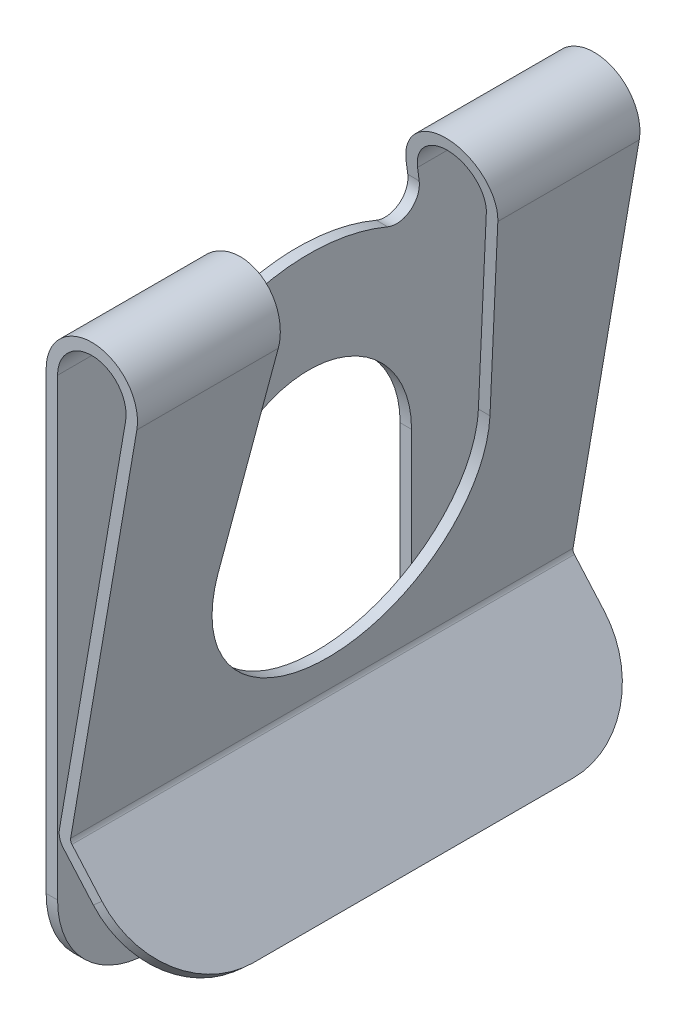
ISO-10303-21;
HEADER;
FILE_DESCRIPTION(('STEP AP214'),'2;1');
FILE_NAME('part.step','',(''),(''),'','','');
FILE_SCHEMA(('AUTOMOTIVE_DESIGN { 1 0 10303 214 1 1 1 1 }'));
ENDSEC;
DATA;
#1=APPLICATION_CONTEXT('core data for automotive mechanical design processes');
#2=APPLICATION_PROTOCOL_DEFINITION('international standard','automotive_design',2000,#1);
#3=PRODUCT_CONTEXT('',#1,'mechanical');
#4=PRODUCT('Part','Part','',(#3));
#5=PRODUCT_RELATED_PRODUCT_CATEGORY('part','',(#4));
#6=PRODUCT_DEFINITION_FORMATION('','',#4);
#7=PRODUCT_DEFINITION_CONTEXT('part definition',#1,'design');
#8=PRODUCT_DEFINITION('design','',#6,#7);
#9=PRODUCT_DEFINITION_SHAPE('','',#8);
#10=(LENGTH_UNIT() NAMED_UNIT(*) SI_UNIT(.MILLI.,.METRE.));
#11=(NAMED_UNIT(*) PLANE_ANGLE_UNIT() SI_UNIT($,.RADIAN.));
#12=(NAMED_UNIT(*) SI_UNIT($,.STERADIAN.) SOLID_ANGLE_UNIT());
#13=UNCERTAINTY_MEASURE_WITH_UNIT(LENGTH_MEASURE(1.E-05),#10,'distance_accuracy_value','');
#14=(GEOMETRIC_REPRESENTATION_CONTEXT(3) GLOBAL_UNCERTAINTY_ASSIGNED_CONTEXT((#13)) GLOBAL_UNIT_ASSIGNED_CONTEXT((#10,
#11,#12)) REPRESENTATION_CONTEXT('',''));
#15=CARTESIAN_POINT('',(0.,0.,0.));
#16=DIRECTION('',(0.,0.,1.));
#17=DIRECTION('',(1.,0.,0.));
#18=AXIS2_PLACEMENT_3D('',#15,#16,#17);
#19=CARTESIAN_POINT('',(0.75519648958121,-8.00818279753097,11.));
#20=DIRECTION('',(0.752689516996334,0.658375645816145,0.));
#21=DIRECTION('',(-0.658375645816145,0.752689516996334,0.));
#22=AXIS2_PLACEMENT_3D('',#19,#20,#21);
#23=PLANE('',#22);
#24=CARTESIAN_POINT('',(2.06668077604698,-9.50754031538768,7.00000000000002));
#25=DIRECTION('',(0.752689516996334,0.658375645816145,0.));
#26=DIRECTION('',(-0.658375645816145,0.752689516996334,0.));
#27=AXIS2_PLACEMENT_3D('',#24,#25,#26);
#28=CIRCLE('',#27,3.99999999999998);
#29=CARTESIAN_POINT('',(2.06668077604697,-9.50754031538767,11.));
#30=VERTEX_POINT('',#29);
#31=CARTESIAN_POINT('',(4.70018335931155,-12.518298383373,7.));
#32=VERTEX_POINT('',#31);
#33=EDGE_CURVE('E405',#30,#32,#28,.T.);
#34=ORIENTED_EDGE('',*,*,#33,.F.);
#35=DIRECTION('',(0.658375645816145,-0.752689516996334,0.));
#36=VECTOR('',#35,1.);
#37=CARTESIAN_POINT('',(0.75519648958121,-8.00818279753097,11.));
#38=LINE('',#37,#36);
#39=CARTESIAN_POINT('',(0.75519648958121,-8.00818279753097,11.));
#40=VERTEX_POINT('',#39);
#41=EDGE_CURVE('E288',#40,#30,#38,.T.);
#42=ORIENTED_EDGE('',*,*,#41,.F.);
#43=DIRECTION('',(0.,0.,-1.));
#44=VECTOR('',#43,1.);
#45=CARTESIAN_POINT('',(0.75519648958121,-8.00818279753097,11.));
#46=LINE('',#45,#44);
#47=CARTESIAN_POINT('',(0.75519648958121,-8.00818279753097,-11.));
#48=VERTEX_POINT('',#47);
#49=EDGE_CURVE('E305',#40,#48,#46,.T.);
#50=ORIENTED_EDGE('',*,*,#49,.T.);
#51=DIRECTION('',(0.658375645816145,-0.752689516996334,0.));
#52=VECTOR('',#51,1.);
#53=CARTESIAN_POINT('',(0.75519648958121,-8.00818279753097,-11.));
#54=LINE('',#53,#52);
#55=CARTESIAN_POINT('',(2.06668077604697,-9.50754031538767,-11.));
#56=VERTEX_POINT('',#55);
#57=EDGE_CURVE('E264',#48,#56,#54,.T.);
#58=ORIENTED_EDGE('',*,*,#57,.T.);
#59=CARTESIAN_POINT('',(2.06668077604697,-9.50754031538767,-7.));
#60=DIRECTION('',(0.752689516996334,0.658375645816145,0.));
#61=DIRECTION('',(-0.658375645816145,0.752689516996334,0.));
#62=AXIS2_PLACEMENT_3D('',#59,#60,#61);
#63=CIRCLE('',#62,4.);
#64=CARTESIAN_POINT('',(4.70018335931155,-12.518298383373,-7.));
#65=VERTEX_POINT('',#64);
#66=EDGE_CURVE('E48',#65,#56,#63,.T.);
#67=ORIENTED_EDGE('',*,*,#66,.F.);
#68=DIRECTION('',(0.,0.,-1.));
#69=VECTOR('',#68,1.);
#70=CARTESIAN_POINT('',(4.70018335931155,-12.518298383373,11.));
#71=LINE('',#70,#69);
#72=EDGE_CURVE('E406',#32,#65,#71,.T.);
#73=ORIENTED_EDGE('',*,*,#72,.F.);
#74=EDGE_LOOP('',(#34,#42,#50,#58,#67,#73));
#75=FACE_BOUND('',#74,.T.);
#76=ADVANCED_FACE('F33',(#75),#23,.F.);
#77=CARTESIAN_POINT('',(5.07677605410829,-12.1893940142257,11.));
#78=DIRECTION('',(-0.752689516996333,-0.658375645816146,0.));
#79=DIRECTION('',(0.658375645816146,-0.752689516996333,0.));
#80=AXIS2_PLACEMENT_3D('',#77,#78,#79);
#81=PLANE('',#80);
#82=CARTESIAN_POINT('',(2.44302553454515,-9.17835249247961,7.00000000000002));
#83=DIRECTION('',(-0.752689516996333,-0.658375645816146,0.));
#84=DIRECTION('',(0.658375645816146,-0.752689516996333,0.));
#85=AXIS2_PLACEMENT_3D('',#82,#83,#84);
#86=CIRCLE('',#85,3.99999999999998);
#87=CARTESIAN_POINT('',(5.07652811780973,-12.1891105604649,7.));
#88=VERTEX_POINT('',#87);
#89=CARTESIAN_POINT('',(2.44302553454514,-9.1783524924796,11.));
#90=VERTEX_POINT('',#89);
#91=EDGE_CURVE('E341',#88,#90,#86,.T.);
#92=ORIENTED_EDGE('',*,*,#91,.F.);
#93=DIRECTION('',(0.,0.,1.));
#94=VECTOR('',#93,1.);
#95=CARTESIAN_POINT('',(5.07652811780973,-12.1891105604649,11.));
#96=LINE('',#95,#94);
#97=CARTESIAN_POINT('',(5.07652811780973,-12.1891105604649,-7.));
#98=VERTEX_POINT('',#97);
#99=EDGE_CURVE('E11',#98,#88,#96,.T.);
#100=ORIENTED_EDGE('',*,*,#99,.F.);
#101=CARTESIAN_POINT('',(2.44302553454514,-9.17835249247959,-7.));
#102=DIRECTION('',(-0.752689516996333,-0.658375645816146,0.));
#103=DIRECTION('',(0.658375645816146,-0.752689516996333,0.));
#104=AXIS2_PLACEMENT_3D('',#101,#102,#103);
#105=CIRCLE('',#104,4.);
#106=CARTESIAN_POINT('',(2.44302553454514,-9.1783524924796,-11.));
#107=VERTEX_POINT('',#106);
#108=EDGE_CURVE('E242',#107,#98,#105,.T.);
#109=ORIENTED_EDGE('',*,*,#108,.F.);
#110=DIRECTION('',(-0.658375645816146,0.752689516996332,0.));
#111=VECTOR('',#110,1.);
#112=CARTESIAN_POINT('',(5.07677605410829,-12.1893940142257,-11.));
#113=LINE('',#112,#111);
#114=CARTESIAN_POINT('',(1.13154124807938,-7.6789949746229,-11.));
#115=VERTEX_POINT('',#114);
#116=EDGE_CURVE('E255',#107,#115,#113,.T.);
#117=ORIENTED_EDGE('',*,*,#116,.T.);
#118=DIRECTION('',(0.,0.,-1.));
#119=VECTOR('',#118,1.);
#120=CARTESIAN_POINT('',(1.13154124807938,-7.6789949746229,11.));
#121=LINE('',#120,#119);
#122=CARTESIAN_POINT('',(1.13154124807938,-7.6789949746229,11.));
#123=VERTEX_POINT('',#122);
#124=EDGE_CURVE('E303',#123,#115,#121,.T.);
#125=ORIENTED_EDGE('',*,*,#124,.F.);
#126=DIRECTION('',(-0.658375645816146,0.752689516996332,0.));
#127=VECTOR('',#126,1.);
#128=CARTESIAN_POINT('',(5.07677605410829,-12.1893940142257,11.));
#129=LINE('',#128,#127);
#130=EDGE_CURVE('E291',#90,#123,#129,.T.);
#131=ORIENTED_EDGE('',*,*,#130,.F.);
#132=EDGE_LOOP('',(#92,#100,#109,#117,#125,#131));
#133=FACE_BOUND('',#132,.T.);
#134=ADVANCED_FACE('F253',(#133),#81,.F.);
#135=CARTESIAN_POINT('',(2.,9.80000000000003,11.));
#136=DIRECTION('',(0.,0.,1.));
#137=DIRECTION('',(1.,0.,0.));
#138=AXIS2_PLACEMENT_3D('',#135,#136,#137);
#139=PLANE('',#138);
#140=ORIENTED_EDGE('',*,*,#41,.T.);
#141=DIRECTION('',(0.752689516996333,0.658375645816146,0.));
#142=VECTOR('',#141,1.);
#143=CARTESIAN_POINT('',(11.5968021945387,-1.1715668470122,11.));
#144=LINE('',#143,#142);
#145=EDGE_CURVE('E41',#30,#90,#144,.T.);
#146=ORIENTED_EDGE('',*,*,#145,.T.);
#147=ORIENTED_EDGE('',*,*,#130,.T.);
#148=CARTESIAN_POINT('',(1.31971362732848,-7.51440106316886,11.));
#149=DIRECTION('',(0.,0.,-1.));
#150=DIRECTION('',(-1.,0.,0.));
#151=AXIS2_PLACEMENT_3D('',#148,#149,#150);
#152=CIRCLE('',#151,0.250000000000019);
#153=CARTESIAN_POINT('',(1.07329577634756,-7.47223184788145,11.));
#154=VERTEX_POINT('',#153);
#155=EDGE_CURVE('E293',#123,#154,#152,.T.);
#156=ORIENTED_EDGE('',*,*,#155,.T.);
#157=DIRECTION('',(0.168676861149636,0.985671403923593,0.));
#158=VECTOR('',#157,1.);
#159=CARTESIAN_POINT('',(1.07329577634756,-7.47223184788145,11.));
#160=LINE('',#159,#158);
#161=CARTESIAN_POINT('',(3.97134280784719,9.46264627770073,11.));
#162=VERTEX_POINT('',#161);
#163=EDGE_CURVE('E295',#154,#162,#160,.T.);
#164=ORIENTED_EDGE('',*,*,#163,.T.);
#165=CARTESIAN_POINT('',(2.,9.80000000000003,11.));
#166=DIRECTION('',(0.,0.,1.));
#167=DIRECTION('',(1.,0.,0.));
#168=AXIS2_PLACEMENT_3D('',#165,#166,#167);
#169=CIRCLE('',#168,2.);
#170=CARTESIAN_POINT('',(0.,9.8,11.));
#171=VERTEX_POINT('',#170);
#172=EDGE_CURVE('E274',#162,#171,#169,.T.);
#173=ORIENTED_EDGE('',*,*,#172,.T.);
#174=DIRECTION('',(0.,-1.,0.));
#175=VECTOR('',#174,1.);
#176=CARTESIAN_POINT('',(0.,9.8,11.));
#177=LINE('',#176,#175);
#178=CARTESIAN_POINT('',(0.,-10.1,11.));
#179=VERTEX_POINT('',#178);
#180=EDGE_CURVE('E277',#171,#179,#177,.T.);
#181=ORIENTED_EDGE('',*,*,#180,.T.);
#182=DIRECTION('',(-1.,0.,0.));
#183=VECTOR('',#182,1.);
#184=CARTESIAN_POINT('',(0.5,-10.1,11.));
#185=LINE('',#184,#183);
#186=CARTESIAN_POINT('',(0.5,-10.1,11.));
#187=VERTEX_POINT('',#186);
#188=EDGE_CURVE('E368',#187,#179,#185,.T.);
#189=ORIENTED_EDGE('',*,*,#188,.F.);
#190=DIRECTION('',(0.,1.,0.));
#191=VECTOR('',#190,1.);
#192=CARTESIAN_POINT('',(0.5,-14.1,11.));
#193=LINE('',#192,#191);
#194=CARTESIAN_POINT('',(0.5,9.8,11.));
#195=VERTEX_POINT('',#194);
#196=EDGE_CURVE('E280',#187,#195,#193,.T.);
#197=ORIENTED_EDGE('',*,*,#196,.T.);
#198=CARTESIAN_POINT('',(2.,9.80000000000003,11.));
#199=DIRECTION('',(0.,0.,-1.));
#200=DIRECTION('',(-1.,0.,0.));
#201=AXIS2_PLACEMENT_3D('',#198,#199,#200);
#202=CIRCLE('',#201,1.5);
#203=CARTESIAN_POINT('',(3.47850710588539,9.54698470827555,11.));
#204=VERTEX_POINT('',#203);
#205=EDGE_CURVE('E282',#195,#204,#202,.T.);
#206=ORIENTED_EDGE('',*,*,#205,.T.);
#207=DIRECTION('',(-0.168676861149636,-0.985671403923593,0.));
#208=VECTOR('',#207,1.);
#209=CARTESIAN_POINT('',(3.47850710588539,9.54698470827555,11.));
#210=LINE('',#209,#208);
#211=CARTESIAN_POINT('',(0.580460074385766,-7.38789341730663,11.));
#212=VERTEX_POINT('',#211);
#213=EDGE_CURVE('E284',#204,#212,#210,.T.);
#214=ORIENTED_EDGE('',*,*,#213,.T.);
#215=CARTESIAN_POINT('',(1.31971362732848,-7.51440106316886,11.));
#216=DIRECTION('',(0.,0.,1.));
#217=DIRECTION('',(1.,0.,0.));
#218=AXIS2_PLACEMENT_3D('',#215,#216,#217);
#219=CIRCLE('',#218,0.750000000000018);
#220=EDGE_CURVE('E286',#212,#40,#219,.T.);
#221=ORIENTED_EDGE('',*,*,#220,.T.);
#222=EDGE_LOOP('',(#140,#146,#147,#156,#164,#173,#181,#189,#197,#206,#214,#221));
#223=FACE_BOUND('',#222,.T.);
#224=ADVANCED_FACE('F337',(#223),#139,.T.);
#225=CARTESIAN_POINT('',(0.,9.8,11.));
#226=DIRECTION('',(1.,0.,0.));
#227=DIRECTION('',(0.,0.,-1.));
#228=AXIS2_PLACEMENT_3D('',#225,#226,#227);
#229=PLANE('',#228);
#230=CARTESIAN_POINT('',(0.,-13.0999999999999,5.50000000000008));
#231=DIRECTION('',(-1.,0.,0.));
#232=DIRECTION('',(0.,0.,1.));
#233=AXIS2_PLACEMENT_3D('',#230,#231,#232);
#234=CIRCLE('',#233,1.00000000000008);
#235=CARTESIAN_POINT('',(0.,-13.1,4.5));
#236=VERTEX_POINT('',#235);
#237=CARTESIAN_POINT('',(0.,-14.1,5.5));
#238=VERTEX_POINT('',#237);
#239=EDGE_CURVE('E56',#236,#238,#234,.T.);
#240=ORIENTED_EDGE('',*,*,#239,.T.);
#241=DIRECTION('',(0.,0.,-1.));
#242=VECTOR('',#241,1.);
#243=CARTESIAN_POINT('',(0.,-14.1,11.));
#244=LINE('',#243,#242);
#245=CARTESIAN_POINT('',(0.,-14.1,7.));
#246=VERTEX_POINT('',#245);
#247=EDGE_CURVE('E322',#246,#238,#244,.T.);
#248=ORIENTED_EDGE('',*,*,#247,.F.);
#249=CARTESIAN_POINT('',(0.,-10.1,7.00000000000002));
#250=DIRECTION('',(-1.,0.,0.));
#251=DIRECTION('',(0.,0.,1.));
#252=AXIS2_PLACEMENT_3D('',#249,#250,#251);
#253=CIRCLE('',#252,3.99999999999998);
#254=EDGE_CURVE('E366',#246,#179,#253,.T.);
#255=ORIENTED_EDGE('',*,*,#254,.T.);
#256=ORIENTED_EDGE('',*,*,#180,.F.);
#257=DIRECTION('',(0.,0.,-1.));
#258=VECTOR('',#257,1.);
#259=CARTESIAN_POINT('',(0.,9.8,11.));
#260=LINE('',#259,#258);
#261=CARTESIAN_POINT('',(0.,9.8,4.76299172278973));
#262=VERTEX_POINT('',#261);
#263=EDGE_CURVE('E326',#171,#262,#260,.T.);
#264=ORIENTED_EDGE('',*,*,#263,.T.);
#265=DIRECTION('',(0.,-0.99146494682926,0.130373537226129));
#266=VECTOR('',#265,1.);
#267=CARTESIAN_POINT('',(0.,8.9937993694177,4.86900376916524));
#268=LINE('',#267,#266);
#269=CARTESIAN_POINT('',(0.,9.25390163352205,4.83480139789608));
#270=VERTEX_POINT('',#269);
#271=EDGE_CURVE('E363',#262,#270,#268,.T.);
#272=ORIENTED_EDGE('',*,*,#271,.T.);
#273=CARTESIAN_POINT('',(0.,9.12352809629592,3.84333645106682));
#274=DIRECTION('',(1.,0.,0.));
#275=DIRECTION('',(0.,0.,-1.));
#276=AXIS2_PLACEMENT_3D('',#273,#274,#275);
#277=CIRCLE('',#276,0.999999999999999);
#278=CARTESIAN_POINT('',(0.,8.20195960990161,3.45512062850816));
#279=VERTEX_POINT('',#278);
#280=EDGE_CURVE('E477',#270,#279,#277,.T.);
#281=ORIENTED_EDGE('',*,*,#280,.T.);
#282=CARTESIAN_POINT('',(0.,0.,0.));
#283=DIRECTION('',(1.,0.,0.));
#284=DIRECTION('',(0.,0.,-1.));
#285=AXIS2_PLACEMENT_3D('',#282,#283,#284);
#286=CIRCLE('',#285,8.90000000000005);
#287=CARTESIAN_POINT('',(0.,8.20195960172058,-3.45512064792876));
#288=VERTEX_POINT('',#287);
#289=EDGE_CURVE('E462',#279,#288,#286,.F.);
#290=ORIENTED_EDGE('',*,*,#289,.T.);
#291=CARTESIAN_POINT('',(0.,9.12352809629592,-3.84333645106683));
#292=DIRECTION('',(1.,0.,0.));
#293=DIRECTION('',(0.,0.,-1.));
#294=AXIS2_PLACEMENT_3D('',#291,#292,#293);
#295=CIRCLE('',#294,0.999999999999995);
#296=CARTESIAN_POINT('',(0.,9.25390163352205,-4.83480139789608));
#297=VERTEX_POINT('',#296);
#298=EDGE_CURVE('E470',#288,#297,#295,.T.);
#299=ORIENTED_EDGE('',*,*,#298,.T.);
#300=DIRECTION('',(0.,0.99146494682926,0.130373537226129));
#301=VECTOR('',#300,1.);
#302=CARTESIAN_POINT('',(0.,11.8375367968023,-4.49506406657047));
#303=LINE('',#302,#301);
#304=CARTESIAN_POINT('',(0.,9.8,-4.76299172278973));
#305=VERTEX_POINT('',#304);
#306=EDGE_CURVE('E473',#297,#305,#303,.T.);
#307=ORIENTED_EDGE('',*,*,#306,.T.);
#308=CARTESIAN_POINT('',(0.,9.8,-11.));
#309=VERTEX_POINT('',#308);
#310=EDGE_CURVE('E325',#305,#309,#260,.T.);
#311=ORIENTED_EDGE('',*,*,#310,.T.);
#312=DIRECTION('',(0.,-1.,0.));
#313=VECTOR('',#312,1.);
#314=CARTESIAN_POINT('',(0.,9.8,-11.));
#315=LINE('',#314,#313);
#316=CARTESIAN_POINT('',(0.,-10.1,-11.));
#317=VERTEX_POINT('',#316);
#318=EDGE_CURVE('E522',#309,#317,#315,.T.);
#319=ORIENTED_EDGE('',*,*,#318,.T.);
#320=CARTESIAN_POINT('',(0.,-10.1,-7.00000000000002));
#321=DIRECTION('',(-1.,0.,0.));
#322=DIRECTION('',(0.,0.,1.));
#323=AXIS2_PLACEMENT_3D('',#320,#321,#322);
#324=CIRCLE('',#323,3.99999999999998);
#325=CARTESIAN_POINT('',(0.,-14.1,-7.));
#326=VERTEX_POINT('',#325);
#327=EDGE_CURVE('E431',#317,#326,#324,.T.);
#328=ORIENTED_EDGE('',*,*,#327,.T.);
#329=CARTESIAN_POINT('',(0.,-14.1,-5.5));
#330=VERTEX_POINT('',#329);
#331=EDGE_CURVE('E321',#330,#326,#244,.T.);
#332=ORIENTED_EDGE('',*,*,#331,.F.);
#333=CARTESIAN_POINT('',(0.,-13.0999999999999,-5.50000000000008));
#334=DIRECTION('',(-1.,0.,0.));
#335=DIRECTION('',(0.,0.,1.));
#336=AXIS2_PLACEMENT_3D('',#333,#334,#335);
#337=CIRCLE('',#336,1.00000000000008);
#338=CARTESIAN_POINT('',(0.,-13.0999999999999,-4.5));
#339=VERTEX_POINT('',#338);
#340=EDGE_CURVE('E421',#330,#339,#337,.T.);
#341=ORIENTED_EDGE('',*,*,#340,.T.);
#342=DIRECTION('',(0.,1.,0.));
#343=VECTOR('',#342,1.);
#344=CARTESIAN_POINT('',(0.,-14.1,-4.5));
#345=LINE('',#344,#343);
#346=CARTESIAN_POINT('',(0.,0.,-4.5));
#347=VERTEX_POINT('',#346);
#348=EDGE_CURVE('E502',#339,#347,#345,.T.);
#349=ORIENTED_EDGE('',*,*,#348,.T.);
#350=CARTESIAN_POINT('',(0.,0.,0.));
#351=DIRECTION('',(1.,0.,0.));
#352=DIRECTION('',(0.,0.,-1.));
#353=AXIS2_PLACEMENT_3D('',#350,#351,#352);
#354=CIRCLE('',#353,4.5);
#355=CARTESIAN_POINT('',(0.,0.,4.5));
#356=VERTEX_POINT('',#355);
#357=EDGE_CURVE('E498',#347,#356,#354,.T.);
#358=ORIENTED_EDGE('',*,*,#357,.T.);
#359=DIRECTION('',(0.,-1.,0.));
#360=VECTOR('',#359,1.);
#361=CARTESIAN_POINT('',(0.,0.,4.5));
#362=LINE('',#361,#360);
#363=EDGE_CURVE('E510',#356,#236,#362,.T.);
#364=ORIENTED_EDGE('',*,*,#363,.T.);
#365=EDGE_LOOP('',(#240,#248,#255,#256,#264,#272,#281,#290,#299,#307,#311,#319,#328,#332,#341,
#349,#358,#364));
#366=FACE_BOUND('',#365,.T.);
#367=ADVANCED_FACE('F361',(#366),#229,.F.);
#368=CARTESIAN_POINT('',(0.5,-14.1,11.));
#369=DIRECTION('',(-1.,0.,0.));
#370=DIRECTION('',(0.,0.,1.));
#371=AXIS2_PLACEMENT_3D('',#368,#369,#370);
#372=PLANE('',#371);
#373=CARTESIAN_POINT('',(0.5,-13.0999999999999,5.50000000000008));
#374=DIRECTION('',(-1.,0.,0.));
#375=DIRECTION('',(0.,0.,1.));
#376=AXIS2_PLACEMENT_3D('',#373,#374,#375);
#377=CIRCLE('',#376,1.00000000000008);
#378=CARTESIAN_POINT('',(0.5,-13.1,4.5));
#379=VERTEX_POINT('',#378);
#380=CARTESIAN_POINT('',(0.5,-14.1,5.5));
#381=VERTEX_POINT('',#380);
#382=EDGE_CURVE('E414',#379,#381,#377,.T.);
#383=ORIENTED_EDGE('',*,*,#382,.F.);
#384=DIRECTION('',(0.,-1.,0.));
#385=VECTOR('',#384,1.);
#386=CARTESIAN_POINT('',(0.5,0.,4.5));
#387=LINE('',#386,#385);
#388=CARTESIAN_POINT('',(0.5,0.,4.5));
#389=VERTEX_POINT('',#388);
#390=EDGE_CURVE('E501',#389,#379,#387,.T.);
#391=ORIENTED_EDGE('',*,*,#390,.F.);
#392=CARTESIAN_POINT('',(0.5,0.,0.));
#393=DIRECTION('',(1.,0.,0.));
#394=DIRECTION('',(0.,0.,-1.));
#395=AXIS2_PLACEMENT_3D('',#392,#393,#394);
#396=CIRCLE('',#395,4.5);
#397=CARTESIAN_POINT('',(0.5,0.,-4.5));
#398=VERTEX_POINT('',#397);
#399=EDGE_CURVE('E499',#398,#389,#396,.T.);
#400=ORIENTED_EDGE('',*,*,#399,.F.);
#401=DIRECTION('',(0.,1.,0.));
#402=VECTOR('',#401,1.);
#403=CARTESIAN_POINT('',(0.5,-14.1,-4.5));
#404=LINE('',#403,#402);
#405=CARTESIAN_POINT('',(0.5,-13.0999999999999,-4.5));
#406=VERTEX_POINT('',#405);
#407=EDGE_CURVE('E505',#406,#398,#404,.T.);
#408=ORIENTED_EDGE('',*,*,#407,.F.);
#409=CARTESIAN_POINT('',(0.5,-13.0999999999999,-5.50000000000008));
#410=DIRECTION('',(-1.,0.,0.));
#411=DIRECTION('',(0.,0.,1.));
#412=AXIS2_PLACEMENT_3D('',#409,#410,#411);
#413=CIRCLE('',#412,1.00000000000008);
#414=CARTESIAN_POINT('',(0.5,-14.1,-5.5));
#415=VERTEX_POINT('',#414);
#416=EDGE_CURVE('E422',#415,#406,#413,.T.);
#417=ORIENTED_EDGE('',*,*,#416,.F.);
#418=DIRECTION('',(0.,0.,-1.));
#419=VECTOR('',#418,1.);
#420=CARTESIAN_POINT('',(0.5,-14.1,11.));
#421=LINE('',#420,#419);
#422=CARTESIAN_POINT('',(0.5,-14.1,-7.));
#423=VERTEX_POINT('',#422);
#424=EDGE_CURVE('E317',#415,#423,#421,.T.);
#425=ORIENTED_EDGE('',*,*,#424,.T.);
#426=CARTESIAN_POINT('',(0.5,-10.1,-7.00000000000002));
#427=DIRECTION('',(-1.,0.,0.));
#428=DIRECTION('',(0.,0.,1.));
#429=AXIS2_PLACEMENT_3D('',#426,#427,#428);
#430=CIRCLE('',#429,3.99999999999998);
#431=CARTESIAN_POINT('',(0.5,-10.1,-11.));
#432=VERTEX_POINT('',#431);
#433=EDGE_CURVE('E432',#432,#423,#430,.T.);
#434=ORIENTED_EDGE('',*,*,#433,.F.);
#435=DIRECTION('',(0.,1.,0.));
#436=VECTOR('',#435,1.);
#437=CARTESIAN_POINT('',(0.5,-14.1,-11.));
#438=LINE('',#437,#436);
#439=CARTESIAN_POINT('',(0.5,9.8,-11.));
#440=VERTEX_POINT('',#439);
#441=EDGE_CURVE('E525',#432,#440,#438,.T.);
#442=ORIENTED_EDGE('',*,*,#441,.T.);
#443=DIRECTION('',(0.,0.,-1.));
#444=VECTOR('',#443,1.);
#445=CARTESIAN_POINT('',(0.5,9.8,11.));
#446=LINE('',#445,#444);
#447=CARTESIAN_POINT('',(0.5,9.80000000000003,-4.76299172278973));
#448=VERTEX_POINT('',#447);
#449=EDGE_CURVE('E313',#448,#440,#446,.T.);
#450=ORIENTED_EDGE('',*,*,#449,.F.);
#451=DIRECTION('',(0.,0.99146494682926,0.130373537226129));
#452=VECTOR('',#451,1.);
#453=CARTESIAN_POINT('',(0.5,9.25390163352205,-4.83480139789608));
#454=LINE('',#453,#452);
#455=CARTESIAN_POINT('',(0.5,9.25390163352205,-4.83480139789608));
#456=VERTEX_POINT('',#455);
#457=EDGE_CURVE('E456',#456,#448,#454,.T.);
#458=ORIENTED_EDGE('',*,*,#457,.F.);
#459=CARTESIAN_POINT('',(0.5,9.12352809629592,-3.84333645106683));
#460=DIRECTION('',(1.,0.,0.));
#461=DIRECTION('',(0.,0.,-1.));
#462=AXIS2_PLACEMENT_3D('',#459,#460,#461);
#463=CIRCLE('',#462,0.999999999999995);
#464=CARTESIAN_POINT('',(0.5,8.20195960172058,-3.45512064792876));
#465=VERTEX_POINT('',#464);
#466=EDGE_CURVE('E453',#465,#456,#463,.T.);
#467=ORIENTED_EDGE('',*,*,#466,.F.);
#468=CARTESIAN_POINT('',(0.5,0.,0.));
#469=DIRECTION('',(-1.,0.,0.));
#470=DIRECTION('',(0.,0.,1.));
#471=AXIS2_PLACEMENT_3D('',#468,#469,#470);
#472=CIRCLE('',#471,8.90000000000005);
#473=CARTESIAN_POINT('',(0.5,8.20195960990161,3.45512062850816));
#474=VERTEX_POINT('',#473);
#475=EDGE_CURVE('E450',#474,#465,#472,.T.);
#476=ORIENTED_EDGE('',*,*,#475,.F.);
#477=CARTESIAN_POINT('',(0.5,9.12352809629592,3.84333645106682));
#478=DIRECTION('',(1.,0.,0.));
#479=DIRECTION('',(0.,0.,-1.));
#480=AXIS2_PLACEMENT_3D('',#477,#478,#479);
#481=CIRCLE('',#480,0.999999999999999);
#482=CARTESIAN_POINT('',(0.5,9.25390163352205,4.83480139789608));
#483=VERTEX_POINT('',#482);
#484=EDGE_CURVE('E447',#483,#474,#481,.T.);
#485=ORIENTED_EDGE('',*,*,#484,.F.);
#486=DIRECTION('',(0.,-0.99146494682926,0.130373537226129));
#487=VECTOR('',#486,1.);
#488=CARTESIAN_POINT('',(0.5,11.8,4.5));
#489=LINE('',#488,#487);
#490=CARTESIAN_POINT('',(0.5,9.80000000000003,4.76299172278973));
#491=VERTEX_POINT('',#490);
#492=EDGE_CURVE('E383',#491,#483,#489,.T.);
#493=ORIENTED_EDGE('',*,*,#492,.F.);
#494=EDGE_CURVE('E314',#195,#491,#446,.T.);
#495=ORIENTED_EDGE('',*,*,#494,.F.);
#496=ORIENTED_EDGE('',*,*,#196,.F.);
#497=CARTESIAN_POINT('',(0.5,-10.1,7.00000000000002));
#498=DIRECTION('',(-1.,0.,0.));
#499=DIRECTION('',(0.,0.,1.));
#500=AXIS2_PLACEMENT_3D('',#497,#498,#499);
#501=CIRCLE('',#500,3.99999999999998);
#502=CARTESIAN_POINT('',(0.5,-14.1,7.));
#503=VERTEX_POINT('',#502);
#504=EDGE_CURVE('E373',#503,#187,#501,.T.);
#505=ORIENTED_EDGE('',*,*,#504,.F.);
#506=EDGE_CURVE('E318',#503,#381,#421,.T.);
#507=ORIENTED_EDGE('',*,*,#506,.T.);
#508=EDGE_LOOP('',(#383,#391,#400,#408,#417,#425,#434,#442,#450,#458,#467,#476,#485,#493,#495,
#496,#505,#507));
#509=FACE_BOUND('',#508,.T.);
#510=ADVANCED_FACE('F378',(#509),#372,.F.);
#511=CARTESIAN_POINT('',(0.,-14.1,11.));
#512=DIRECTION('',(0.,1.,0.));
#513=DIRECTION('',(0.,0.,1.));
#514=AXIS2_PLACEMENT_3D('',#511,#512,#513);
#515=PLANE('',#514);
#516=DIRECTION('',(-1.,0.,0.));
#517=VECTOR('',#516,1.);
#518=CARTESIAN_POINT('',(0.5,-14.1,5.5));
#519=LINE('',#518,#517);
#520=EDGE_CURVE('E419',#381,#238,#519,.T.);
#521=ORIENTED_EDGE('',*,*,#520,.F.);
#522=ORIENTED_EDGE('',*,*,#506,.F.);
#523=DIRECTION('',(-1.,0.,0.));
#524=VECTOR('',#523,1.);
#525=CARTESIAN_POINT('',(0.5,-14.1,7.));
#526=LINE('',#525,#524);
#527=EDGE_CURVE('E372',#503,#246,#526,.T.);
#528=ORIENTED_EDGE('',*,*,#527,.T.);
#529=ORIENTED_EDGE('',*,*,#247,.T.);
#530=EDGE_LOOP('',(#521,#522,#528,#529));
#531=FACE_BOUND('',#530,.T.);
#532=ADVANCED_FACE('F570',(#531),#515,.F.);
#533=CARTESIAN_POINT('',(0.5,0.,4.5));
#534=DIRECTION('',(0.,0.,-1.));
#535=DIRECTION('',(-1.,0.,0.));
#536=AXIS2_PLACEMENT_3D('',#533,#534,#535);
#537=PLANE('',#536);
#538=ORIENTED_EDGE('',*,*,#390,.T.);
#539=DIRECTION('',(-1.,0.,0.));
#540=VECTOR('',#539,1.);
#541=CARTESIAN_POINT('',(0.5,-13.1,4.5));
#542=LINE('',#541,#540);
#543=EDGE_CURVE('E416',#379,#236,#542,.T.);
#544=ORIENTED_EDGE('',*,*,#543,.T.);
#545=ORIENTED_EDGE('',*,*,#363,.F.);
#546=DIRECTION('',(-1.,0.,0.));
#547=VECTOR('',#546,1.);
#548=CARTESIAN_POINT('',(0.5,0.,4.5));
#549=LINE('',#548,#547);
#550=EDGE_CURVE('E516',#389,#356,#549,.T.);
#551=ORIENTED_EDGE('',*,*,#550,.F.);
#552=EDGE_LOOP('',(#538,#544,#545,#551));
#553=FACE_BOUND('',#552,.T.);
#554=ADVANCED_FACE('F572',(#553),#537,.T.);
#555=ORIENTED_EDGE('',*,*,#424,.F.);
#556=DIRECTION('',(-1.,0.,0.));
#557=VECTOR('',#556,1.);
#558=CARTESIAN_POINT('',(0.5,-14.1,-5.5));
#559=LINE('',#558,#557);
#560=EDGE_CURVE('E428',#415,#330,#559,.T.);
#561=ORIENTED_EDGE('',*,*,#560,.T.);
#562=ORIENTED_EDGE('',*,*,#331,.T.);
#563=DIRECTION('',(-1.,0.,0.));
#564=VECTOR('',#563,1.);
#565=CARTESIAN_POINT('',(0.5,-14.1,-7.));
#566=LINE('',#565,#564);
#567=EDGE_CURVE('E440',#423,#326,#566,.T.);
#568=ORIENTED_EDGE('',*,*,#567,.F.);
#569=EDGE_LOOP('',(#555,#561,#562,#568));
#570=FACE_BOUND('',#569,.T.);
#571=ADVANCED_FACE('F574',(#570),#515,.F.);
#572=CARTESIAN_POINT('',(2.,9.80000000000003,11.));
#573=DIRECTION('',(0.,0.,-1.));
#574=DIRECTION('',(-1.,0.,0.));
#575=AXIS2_PLACEMENT_3D('',#572,#573,#574);
#576=CYLINDRICAL_SURFACE('',#575,2.);
#577=CARTESIAN_POINT('',(2.,9.80000000000003,4.76299172278973));
#578=DIRECTION('',(0.,-0.13037353722613,-0.99146494682926));
#579=DIRECTION('',(0.,0.99146494682926,-0.13037353722613));
#580=AXIS2_PLACEMENT_3D('',#577,#578,#579);
#581=ELLIPSE('',#580,2.01721705481982,2.);
#582=CARTESIAN_POINT('',(3.97134280784719,9.46264627770073,4.80735234109824));
#583=VERTEX_POINT('',#582);
#584=EDGE_CURVE('E357',#262,#583,#581,.T.);
#585=ORIENTED_EDGE('',*,*,#584,.F.);
#586=ORIENTED_EDGE('',*,*,#263,.F.);
#587=ORIENTED_EDGE('',*,*,#172,.F.);
#588=DIRECTION('',(0.,0.,-1.));
#589=VECTOR('',#588,1.);
#590=CARTESIAN_POINT('',(3.97134280784719,9.46264627770073,11.));
#591=LINE('',#590,#589);
#592=EDGE_CURVE('E298',#162,#583,#591,.T.);
#593=ORIENTED_EDGE('',*,*,#592,.T.);
#594=EDGE_LOOP('',(#585,#586,#587,#593));
#595=FACE_BOUND('',#594,.T.);
#596=ADVANCED_FACE('F356',(#595),#576,.T.);
#597=ORIENTED_EDGE('',*,*,#310,.F.);
#598=CARTESIAN_POINT('',(2.,9.80000000000003,-4.76299172278973));
#599=DIRECTION('',(0.,-0.13037353722613,0.99146494682926));
#600=DIRECTION('',(0.,-0.99146494682926,-0.13037353722613));
#601=AXIS2_PLACEMENT_3D('',#598,#599,#600);
#602=ELLIPSE('',#601,2.01721705481982,2.);
#603=CARTESIAN_POINT('',(3.97134280784719,9.46264627770073,-4.80735234109824));
#604=VERTEX_POINT('',#603);
#605=EDGE_CURVE('E489',#604,#305,#602,.T.);
#606=ORIENTED_EDGE('',*,*,#605,.F.);
#607=CARTESIAN_POINT('',(3.97134280784719,9.46264627770073,-11.));
#608=VERTEX_POINT('',#607);
#609=EDGE_CURVE('E297',#604,#608,#591,.T.);
#610=ORIENTED_EDGE('',*,*,#609,.T.);
#611=CARTESIAN_POINT('',(2.,9.80000000000003,-11.));
#612=DIRECTION('',(0.,0.,1.));
#613=DIRECTION('',(1.,0.,0.));
#614=AXIS2_PLACEMENT_3D('',#611,#612,#613);
#615=CIRCLE('',#614,2.);
#616=EDGE_CURVE('E519',#608,#309,#615,.T.);
#617=ORIENTED_EDGE('',*,*,#616,.T.);
#618=EDGE_LOOP('',(#597,#606,#610,#617));
#619=FACE_BOUND('',#618,.T.);
#620=ADVANCED_FACE('F35',(#619),#576,.T.);
#621=CARTESIAN_POINT('',(2.,9.80000000000003,11.));
#622=DIRECTION('',(0.,0.,-1.));
#623=DIRECTION('',(-1.,0.,0.));
#624=AXIS2_PLACEMENT_3D('',#621,#622,#623);
#625=CYLINDRICAL_SURFACE('',#624,1.5);
#626=CARTESIAN_POINT('',(2.,9.80000000000003,-4.76299172278973));
#627=DIRECTION('',(0.,-0.13037353722613,0.99146494682926));
#628=DIRECTION('',(0.,-0.99146494682926,-0.13037353722613));
#629=AXIS2_PLACEMENT_3D('',#626,#627,#628);
#630=ELLIPSE('',#629,1.51291279111486,1.5);
#631=CARTESIAN_POINT('',(3.47850710588539,9.54698470827555,-4.79626218652111));
#632=VERTEX_POINT('',#631);
#633=EDGE_CURVE('E493',#448,#632,#630,.F.);
#634=ORIENTED_EDGE('',*,*,#633,.F.);
#635=ORIENTED_EDGE('',*,*,#449,.T.);
#636=CARTESIAN_POINT('',(2.,9.80000000000003,-11.));
#637=DIRECTION('',(0.,0.,-1.));
#638=DIRECTION('',(-1.,0.,0.));
#639=AXIS2_PLACEMENT_3D('',#636,#637,#638);
#640=CIRCLE('',#639,1.5);
#641=CARTESIAN_POINT('',(3.47850710588539,9.54698470827555,-11.));
#642=VERTEX_POINT('',#641);
#643=EDGE_CURVE('E527',#440,#642,#640,.T.);
#644=ORIENTED_EDGE('',*,*,#643,.T.);
#645=DIRECTION('',(0.,0.,-1.));
#646=VECTOR('',#645,1.);
#647=CARTESIAN_POINT('',(3.47850710588539,9.54698470827555,11.));
#648=LINE('',#647,#646);
#649=EDGE_CURVE('E309',#632,#642,#648,.T.);
#650=ORIENTED_EDGE('',*,*,#649,.F.);
#651=EDGE_LOOP('',(#634,#635,#644,#650));
#652=FACE_BOUND('',#651,.T.);
#653=ADVANCED_FACE('F535',(#652),#625,.F.);
#654=CARTESIAN_POINT('',(2.,9.80000000000003,4.76299172278973));
#655=DIRECTION('',(0.,-0.13037353722613,-0.99146494682926));
#656=DIRECTION('',(0.,0.99146494682926,-0.13037353722613));
#657=AXIS2_PLACEMENT_3D('',#654,#655,#656);
#658=ELLIPSE('',#657,1.51291279111486,1.5);
#659=CARTESIAN_POINT('',(3.47850710588539,9.54698470827555,4.79626218652111));
#660=VERTEX_POINT('',#659);
#661=EDGE_CURVE('E487',#660,#491,#658,.F.);
#662=ORIENTED_EDGE('',*,*,#661,.F.);
#663=EDGE_CURVE('E310',#204,#660,#648,.T.);
#664=ORIENTED_EDGE('',*,*,#663,.F.);
#665=ORIENTED_EDGE('',*,*,#205,.F.);
#666=ORIENTED_EDGE('',*,*,#494,.T.);
#667=EDGE_LOOP('',(#662,#664,#665,#666));
#668=FACE_BOUND('',#667,.T.);
#669=ADVANCED_FACE('F388',(#668),#625,.F.);
#670=CARTESIAN_POINT('',(3.47850710588539,9.54698470827555,11.));
#671=DIRECTION('',(0.985671403923593,-0.168676861149636,0.));
#672=DIRECTION('',(0.168676861149636,0.985671403923593,0.));
#673=AXIS2_PLACEMENT_3D('',#670,#671,#672);
#674=PLANE('',#673);
#675=DIRECTION('',(-0.16727764813555,-0.977495034938645,-0.128536551628463));
#676=VECTOR('',#675,1.);
#677=CARTESIAN_POINT('',(3.81814715254877,11.5316877632274,-4.5352819486972));
#678=LINE('',#677,#676);
#679=CARTESIAN_POINT('',(1.97860621200451,0.782241223356779,-5.94878968097556));
#680=VERTEX_POINT('',#679);
#681=EDGE_CURVE('E491',#632,#680,#678,.T.);
#682=ORIENTED_EDGE('',*,*,#681,.F.);
#683=ORIENTED_EDGE('',*,*,#649,.T.);
#684=DIRECTION('',(-0.168676861149636,-0.985671403923593,0.));
#685=VECTOR('',#684,1.);
#686=CARTESIAN_POINT('',(3.47850710588539,9.54698470827555,-11.));
#687=LINE('',#686,#685);
#688=CARTESIAN_POINT('',(0.580460074385766,-7.38789341730663,-11.));
#689=VERTEX_POINT('',#688);
#690=EDGE_CURVE('E398',#642,#689,#687,.T.);
#691=ORIENTED_EDGE('',*,*,#690,.T.);
#692=DIRECTION('',(0.,0.,-1.));
#693=VECTOR('',#692,1.);
#694=CARTESIAN_POINT('',(0.580460074385766,-7.38789341730663,11.));
#695=LINE('',#694,#693);
#696=EDGE_CURVE('E307',#212,#689,#695,.T.);
#697=ORIENTED_EDGE('',*,*,#696,.F.);
#698=ORIENTED_EDGE('',*,*,#213,.F.);
#699=ORIENTED_EDGE('',*,*,#663,.T.);
#700=DIRECTION('',(0.16727764813555,0.977495034938645,-0.128536551628463));
#701=VECTOR('',#700,1.);
#702=CARTESIAN_POINT('',(3.34511872731978,8.76752326067829,4.89875814099701));
#703=LINE('',#702,#701);
#704=CARTESIAN_POINT('',(1.97860621200451,0.78224122335678,5.94878968097556));
#705=VERTEX_POINT('',#704);
#706=EDGE_CURVE('E485',#705,#660,#703,.T.);
#707=ORIENTED_EDGE('',*,*,#706,.F.);
#708=CARTESIAN_POINT('',(1.84474213347647,0.,0.));
#709=DIRECTION('',(0.985671403923593,-0.168676861149636,0.));
#710=DIRECTION('',(-0.168676861149636,-0.985671403923593,0.));
#711=AXIS2_PLACEMENT_3D('',#708,#709,#710);
#712=ELLIPSE('',#711,6.08722133574762,6.);
#713=EDGE_CURVE('E495',#680,#705,#712,.F.);
#714=ORIENTED_EDGE('',*,*,#713,.F.);
#715=EDGE_LOOP('',(#682,#683,#691,#697,#698,#699,#707,#714));
#716=FACE_BOUND('',#715,.T.);
#717=ADVANCED_FACE('F396',(#716),#674,.F.);
#718=CARTESIAN_POINT('',(1.07329577634756,-7.47223184788145,11.));
#719=DIRECTION('',(-0.985671403923593,0.168676861149636,0.));
#720=DIRECTION('',(-0.168676861149636,-0.985671403923593,0.));
#721=AXIS2_PLACEMENT_3D('',#718,#719,#720);
#722=PLANE('',#721);
#723=DIRECTION('',(0.16727764813555,0.977495034938645,0.128536551628463));
#724=VECTOR('',#723,1.);
#725=CARTESIAN_POINT('',(1.46105478021414,-5.20634333703157,-6.73626376627983));
#726=LINE('',#725,#724);
#727=CARTESIAN_POINT('',(2.48587465665014,0.782241223356779,-5.94878968097556));
#728=VERTEX_POINT('',#727);
#729=EDGE_CURVE('E248',#728,#604,#726,.T.);
#730=ORIENTED_EDGE('',*,*,#729,.F.);
#731=CARTESIAN_POINT('',(2.3520105781221,0.,0.));
#732=DIRECTION('',(-0.985671403923593,0.168676861149636,0.));
#733=DIRECTION('',(-0.168676861149636,-0.985671403923593,0.));
#734=AXIS2_PLACEMENT_3D('',#731,#732,#733);
#735=ELLIPSE('',#734,6.08722133574762,6.);
#736=CARTESIAN_POINT('',(2.48587465665014,0.782241223356779,5.94878968097556));
#737=VERTEX_POINT('',#736);
#738=EDGE_CURVE('E331',#737,#728,#735,.F.);
#739=ORIENTED_EDGE('',*,*,#738,.F.);
#740=DIRECTION('',(-0.16727764813555,-0.977495034938645,0.128536551628463));
#741=VECTOR('',#740,1.);
#742=CARTESIAN_POINT('',(0.988026354985149,-7.97050783958063,7.09973995857963));
#743=LINE('',#742,#741);
#744=EDGE_CURVE('E329',#583,#737,#743,.T.);
#745=ORIENTED_EDGE('',*,*,#744,.F.);
#746=ORIENTED_EDGE('',*,*,#592,.F.);
#747=ORIENTED_EDGE('',*,*,#163,.F.);
#748=DIRECTION('',(0.,0.,-1.));
#749=VECTOR('',#748,1.);
#750=CARTESIAN_POINT('',(1.07329577634756,-7.47223184788145,11.));
#751=LINE('',#750,#749);
#752=CARTESIAN_POINT('',(1.07329577634756,-7.47223184788145,-11.));
#753=VERTEX_POINT('',#752);
#754=EDGE_CURVE('E301',#154,#753,#751,.T.);
#755=ORIENTED_EDGE('',*,*,#754,.T.);
#756=DIRECTION('',(0.168676861149636,0.985671403923593,0.));
#757=VECTOR('',#756,1.);
#758=CARTESIAN_POINT('',(1.07329577634756,-7.47223184788145,-11.));
#759=LINE('',#758,#757);
#760=EDGE_CURVE('E266',#753,#608,#759,.T.);
#761=ORIENTED_EDGE('',*,*,#760,.T.);
#762=ORIENTED_EDGE('',*,*,#609,.F.);
#763=EDGE_LOOP('',(#730,#739,#745,#746,#747,#755,#761,#762));
#764=FACE_BOUND('',#763,.T.);
#765=ADVANCED_FACE('F353',(#764),#722,.F.);
#766=CARTESIAN_POINT('',(1.31971362732848,-7.51440106316886,11.));
#767=DIRECTION('',(0.,0.,-1.));
#768=DIRECTION('',(-1.,0.,0.));
#769=AXIS2_PLACEMENT_3D('',#766,#767,#768);
#770=CYLINDRICAL_SURFACE('',#769,0.750000000000018);
#771=ORIENTED_EDGE('',*,*,#696,.T.);
#772=CARTESIAN_POINT('',(1.31971362732848,-7.51440106316886,-11.));
#773=DIRECTION('',(0.,0.,1.));
#774=DIRECTION('',(1.,0.,0.));
#775=AXIS2_PLACEMENT_3D('',#772,#773,#774);
#776=CIRCLE('',#775,0.750000000000018);
#777=EDGE_CURVE('E268',#689,#48,#776,.T.);
#778=ORIENTED_EDGE('',*,*,#777,.T.);
#779=ORIENTED_EDGE('',*,*,#49,.F.);
#780=ORIENTED_EDGE('',*,*,#220,.F.);
#781=EDGE_LOOP('',(#771,#778,#779,#780));
#782=FACE_BOUND('',#781,.T.);
#783=ADVANCED_FACE('F402',(#782),#770,.T.);
#784=CARTESIAN_POINT('',(1.31971362732848,-7.51440106316886,11.));
#785=DIRECTION('',(0.,0.,-1.));
#786=DIRECTION('',(-1.,0.,0.));
#787=AXIS2_PLACEMENT_3D('',#784,#785,#786);
#788=CYLINDRICAL_SURFACE('',#787,0.250000000000019);
#789=ORIENTED_EDGE('',*,*,#124,.T.);
#790=CARTESIAN_POINT('',(1.31971362732848,-7.51440106316886,-11.));
#791=DIRECTION('',(0.,0.,-1.));
#792=DIRECTION('',(-1.,0.,0.));
#793=AXIS2_PLACEMENT_3D('',#790,#791,#792);
#794=CIRCLE('',#793,0.250000000000019);
#795=EDGE_CURVE('E263',#115,#753,#794,.T.);
#796=ORIENTED_EDGE('',*,*,#795,.T.);
#797=ORIENTED_EDGE('',*,*,#754,.F.);
#798=ORIENTED_EDGE('',*,*,#155,.F.);
#799=EDGE_LOOP('',(#789,#796,#797,#798));
#800=FACE_BOUND('',#799,.T.);
#801=ADVANCED_FACE('F345',(#800),#788,.F.);
#802=CARTESIAN_POINT('',(2.,9.80000000000003,-11.));
#803=DIRECTION('',(0.,0.,1.));
#804=DIRECTION('',(1.,0.,0.));
#805=AXIS2_PLACEMENT_3D('',#802,#803,#804);
#806=PLANE('',#805);
#807=ORIENTED_EDGE('',*,*,#116,.F.);
#808=DIRECTION('',(-0.752689516996333,-0.658375645816146,0.));
#809=VECTOR('',#808,1.);
#810=CARTESIAN_POINT('',(3.19571505154147,-8.51997684666345,-11.));
#811=LINE('',#810,#809);
#812=EDGE_CURVE('E239',#107,#56,#811,.T.);
#813=ORIENTED_EDGE('',*,*,#812,.T.);
#814=ORIENTED_EDGE('',*,*,#57,.F.);
#815=ORIENTED_EDGE('',*,*,#777,.F.);
#816=ORIENTED_EDGE('',*,*,#690,.F.);
#817=ORIENTED_EDGE('',*,*,#643,.F.);
#818=ORIENTED_EDGE('',*,*,#441,.F.);
#819=DIRECTION('',(-1.,0.,0.));
#820=VECTOR('',#819,1.);
#821=CARTESIAN_POINT('',(0.5,-10.1,-11.));
#822=LINE('',#821,#820);
#823=EDGE_CURVE('E435',#432,#317,#822,.T.);
#824=ORIENTED_EDGE('',*,*,#823,.T.);
#825=ORIENTED_EDGE('',*,*,#318,.F.);
#826=ORIENTED_EDGE('',*,*,#616,.F.);
#827=ORIENTED_EDGE('',*,*,#760,.F.);
#828=ORIENTED_EDGE('',*,*,#795,.F.);
#829=EDGE_LOOP('',(#807,#813,#814,#815,#816,#817,#818,#824,#825,#826,#827,#828));
#830=FACE_BOUND('',#829,.T.);
#831=ADVANCED_FACE('F260',(#830),#806,.F.);
#832=CARTESIAN_POINT('',(0.5,0.,0.));
#833=DIRECTION('',(-1.,0.,0.));
#834=DIRECTION('',(0.,0.,1.));
#835=AXIS2_PLACEMENT_3D('',#832,#833,#834);
#836=CYLINDRICAL_SURFACE('',#835,4.5);
#837=ORIENTED_EDGE('',*,*,#357,.F.);
#838=DIRECTION('',(-1.,0.,0.));
#839=VECTOR('',#838,1.);
#840=CARTESIAN_POINT('',(0.5,0.,-4.5));
#841=LINE('',#840,#839);
#842=EDGE_CURVE('E507',#398,#347,#841,.T.);
#843=ORIENTED_EDGE('',*,*,#842,.F.);
#844=ORIENTED_EDGE('',*,*,#399,.T.);
#845=ORIENTED_EDGE('',*,*,#550,.T.);
#846=EDGE_LOOP('',(#837,#843,#844,#845));
#847=FACE_BOUND('',#846,.T.);
#848=ADVANCED_FACE('F590',(#847),#836,.F.);
#849=CARTESIAN_POINT('',(0.5,-14.1,-4.5));
#850=DIRECTION('',(0.,0.,1.));
#851=DIRECTION('',(1.,0.,0.));
#852=AXIS2_PLACEMENT_3D('',#849,#850,#851);
#853=PLANE('',#852);
#854=DIRECTION('',(-1.,0.,0.));
#855=VECTOR('',#854,1.);
#856=CARTESIAN_POINT('',(0.5,-13.0999999999999,-4.5));
#857=LINE('',#856,#855);
#858=EDGE_CURVE('E424',#406,#339,#857,.T.);
#859=ORIENTED_EDGE('',*,*,#858,.F.);
#860=ORIENTED_EDGE('',*,*,#407,.T.);
#861=ORIENTED_EDGE('',*,*,#842,.T.);
#862=ORIENTED_EDGE('',*,*,#348,.F.);
#863=EDGE_LOOP('',(#859,#860,#861,#862));
#864=FACE_BOUND('',#863,.T.);
#865=ADVANCED_FACE('F594',(#864),#853,.T.);
#866=CARTESIAN_POINT('',(5.5,0.,0.));
#867=DIRECTION('',(-1.,0.,0.));
#868=DIRECTION('',(0.,0.,1.));
#869=AXIS2_PLACEMENT_3D('',#866,#867,#868);
#870=CYLINDRICAL_SURFACE('',#869,6.);
#871=ORIENTED_EDGE('',*,*,#713,.T.);
#872=DIRECTION('',(-1.,0.,0.));
#873=VECTOR('',#872,1.);
#874=CARTESIAN_POINT('',(5.5,0.782241223356779,5.94878968097556));
#875=LINE('',#874,#873);
#876=EDGE_CURVE('E479',#737,#705,#875,.T.);
#877=ORIENTED_EDGE('',*,*,#876,.F.);
#878=ORIENTED_EDGE('',*,*,#738,.T.);
#879=DIRECTION('',(-1.,0.,0.));
#880=VECTOR('',#879,1.);
#881=CARTESIAN_POINT('',(5.5,0.782241223356779,-5.94878968097556));
#882=LINE('',#881,#880);
#883=EDGE_CURVE('E481',#728,#680,#882,.T.);
#884=ORIENTED_EDGE('',*,*,#883,.T.);
#885=EDGE_LOOP('',(#871,#877,#878,#884));
#886=FACE_BOUND('',#885,.T.);
#887=ADVANCED_FACE('F599',(#886),#870,.F.);
#888=CARTESIAN_POINT('',(5.5,0.782241223356779,-5.94878968097556));
#889=DIRECTION('',(0.,-0.13037353722613,0.99146494682926));
#890=DIRECTION('',(0.,-0.99146494682926,-0.13037353722613));
#891=AXIS2_PLACEMENT_3D('',#888,#889,#890);
#892=PLANE('',#891);
#893=ORIENTED_EDGE('',*,*,#633,.T.);
#894=ORIENTED_EDGE('',*,*,#681,.T.);
#895=ORIENTED_EDGE('',*,*,#883,.F.);
#896=ORIENTED_EDGE('',*,*,#729,.T.);
#897=ORIENTED_EDGE('',*,*,#605,.T.);
#898=ORIENTED_EDGE('',*,*,#306,.F.);
#899=DIRECTION('',(1.,0.,0.));
#900=VECTOR('',#899,1.);
#901=CARTESIAN_POINT('',(-4.5,9.25390163352205,-4.83480139789608));
#902=LINE('',#901,#900);
#903=EDGE_CURVE('E463',#297,#456,#902,.T.);
#904=ORIENTED_EDGE('',*,*,#903,.T.);
#905=ORIENTED_EDGE('',*,*,#457,.T.);
#906=EDGE_LOOP('',(#893,#894,#895,#896,#897,#898,#904,#905));
#907=FACE_BOUND('',#906,.T.);
#908=ADVANCED_FACE('F609',(#907),#892,.T.);
#909=CARTESIAN_POINT('',(5.5,11.8,4.5));
#910=DIRECTION('',(0.,-0.13037353722613,-0.99146494682926));
#911=DIRECTION('',(0.,0.99146494682926,-0.13037353722613));
#912=AXIS2_PLACEMENT_3D('',#909,#910,#911);
#913=PLANE('',#912);
#914=ORIENTED_EDGE('',*,*,#661,.T.);
#915=ORIENTED_EDGE('',*,*,#492,.T.);
#916=DIRECTION('',(1.,0.,0.));
#917=VECTOR('',#916,1.);
#918=CARTESIAN_POINT('',(-4.5,9.25390163352205,4.83480139789608));
#919=LINE('',#918,#917);
#920=EDGE_CURVE('E460',#270,#483,#919,.T.);
#921=ORIENTED_EDGE('',*,*,#920,.F.);
#922=ORIENTED_EDGE('',*,*,#271,.F.);
#923=ORIENTED_EDGE('',*,*,#584,.T.);
#924=ORIENTED_EDGE('',*,*,#744,.T.);
#925=ORIENTED_EDGE('',*,*,#876,.T.);
#926=ORIENTED_EDGE('',*,*,#706,.T.);
#927=EDGE_LOOP('',(#914,#915,#921,#922,#923,#924,#925,#926));
#928=FACE_BOUND('',#927,.T.);
#929=ADVANCED_FACE('F613',(#928),#913,.T.);
#930=CARTESIAN_POINT('',(-4.5,9.12352809629592,3.84333645106682));
#931=DIRECTION('',(1.,0.,0.));
#932=DIRECTION('',(0.,0.,-1.));
#933=AXIS2_PLACEMENT_3D('',#930,#931,#932);
#934=CYLINDRICAL_SURFACE('',#933,0.999999999999999);
#935=ORIENTED_EDGE('',*,*,#920,.T.);
#936=ORIENTED_EDGE('',*,*,#484,.T.);
#937=DIRECTION('',(1.,0.,0.));
#938=VECTOR('',#937,1.);
#939=CARTESIAN_POINT('',(-4.5,8.20195960990161,3.45512062850816));
#940=LINE('',#939,#938);
#941=EDGE_CURVE('E459',#279,#474,#940,.T.);
#942=ORIENTED_EDGE('',*,*,#941,.F.);
#943=ORIENTED_EDGE('',*,*,#280,.F.);
#944=EDGE_LOOP('',(#935,#936,#942,#943));
#945=FACE_BOUND('',#944,.T.);
#946=ADVANCED_FACE('F617',(#945),#934,.F.);
#947=CARTESIAN_POINT('',(-4.5,9.12352809629592,-3.84333645106683));
#948=DIRECTION('',(1.,0.,0.));
#949=DIRECTION('',(0.,0.,-1.));
#950=AXIS2_PLACEMENT_3D('',#947,#948,#949);
#951=CYLINDRICAL_SURFACE('',#950,0.999999999999995);
#952=DIRECTION('',(1.,0.,0.));
#953=VECTOR('',#952,1.);
#954=CARTESIAN_POINT('',(-4.5,8.20195960172058,-3.45512064792876));
#955=LINE('',#954,#953);
#956=EDGE_CURVE('E465',#288,#465,#955,.T.);
#957=ORIENTED_EDGE('',*,*,#956,.T.);
#958=ORIENTED_EDGE('',*,*,#466,.T.);
#959=ORIENTED_EDGE('',*,*,#903,.F.);
#960=ORIENTED_EDGE('',*,*,#298,.F.);
#961=EDGE_LOOP('',(#957,#958,#959,#960));
#962=FACE_BOUND('',#961,.T.);
#963=ADVANCED_FACE('F621',(#962),#951,.F.);
#964=CARTESIAN_POINT('',(-4.5,0.,0.));
#965=DIRECTION('',(1.,0.,0.));
#966=DIRECTION('',(0.,0.,-1.));
#967=AXIS2_PLACEMENT_3D('',#964,#965,#966);
#968=CYLINDRICAL_SURFACE('',#967,8.90000000000005);
#969=ORIENTED_EDGE('',*,*,#941,.T.);
#970=ORIENTED_EDGE('',*,*,#475,.T.);
#971=ORIENTED_EDGE('',*,*,#956,.F.);
#972=ORIENTED_EDGE('',*,*,#289,.F.);
#973=EDGE_LOOP('',(#969,#970,#971,#972));
#974=FACE_BOUND('',#973,.T.);
#975=ADVANCED_FACE('F623',(#974),#968,.T.);
#976=CARTESIAN_POINT('',(0.5,-10.1,7.00000000000002));
#977=DIRECTION('',(-1.,0.,0.));
#978=DIRECTION('',(0.,0.,1.));
#979=AXIS2_PLACEMENT_3D('',#976,#977,#978);
#980=CYLINDRICAL_SURFACE('',#979,3.99999999999998);
#981=ORIENTED_EDGE('',*,*,#254,.F.);
#982=ORIENTED_EDGE('',*,*,#527,.F.);
#983=ORIENTED_EDGE('',*,*,#504,.T.);
#984=ORIENTED_EDGE('',*,*,#188,.T.);
#985=EDGE_LOOP('',(#981,#982,#983,#984));
#986=FACE_BOUND('',#985,.T.);
#987=ADVANCED_FACE('F626',(#986),#980,.T.);
#988=CARTESIAN_POINT('',(0.5,-10.1,-7.00000000000002));
#989=DIRECTION('',(-1.,0.,0.));
#990=DIRECTION('',(0.,0.,1.));
#991=AXIS2_PLACEMENT_3D('',#988,#989,#990);
#992=CYLINDRICAL_SURFACE('',#991,3.99999999999998);
#993=ORIENTED_EDGE('',*,*,#327,.F.);
#994=ORIENTED_EDGE('',*,*,#823,.F.);
#995=ORIENTED_EDGE('',*,*,#433,.T.);
#996=ORIENTED_EDGE('',*,*,#567,.T.);
#997=EDGE_LOOP('',(#993,#994,#995,#996));
#998=FACE_BOUND('',#997,.T.);
#999=ADVANCED_FACE('F633',(#998),#992,.T.);
#1000=CARTESIAN_POINT('',(0.5,-13.0999999999999,-5.50000000000008));
#1001=DIRECTION('',(-1.,0.,0.));
#1002=DIRECTION('',(0.,0.,1.));
#1003=AXIS2_PLACEMENT_3D('',#1000,#1001,#1002);
#1004=CYLINDRICAL_SURFACE('',#1003,1.00000000000008);
#1005=ORIENTED_EDGE('',*,*,#340,.F.);
#1006=ORIENTED_EDGE('',*,*,#560,.F.);
#1007=ORIENTED_EDGE('',*,*,#416,.T.);
#1008=ORIENTED_EDGE('',*,*,#858,.T.);
#1009=EDGE_LOOP('',(#1005,#1006,#1007,#1008));
#1010=FACE_BOUND('',#1009,.T.);
#1011=ADVANCED_FACE('F636',(#1010),#1004,.T.);
#1012=CARTESIAN_POINT('',(0.5,-13.0999999999999,5.50000000000008));
#1013=DIRECTION('',(-1.,0.,0.));
#1014=DIRECTION('',(0.,0.,1.));
#1015=AXIS2_PLACEMENT_3D('',#1012,#1013,#1014);
#1016=CYLINDRICAL_SURFACE('',#1015,1.00000000000008);
#1017=ORIENTED_EDGE('',*,*,#239,.F.);
#1018=ORIENTED_EDGE('',*,*,#543,.F.);
#1019=ORIENTED_EDGE('',*,*,#382,.T.);
#1020=ORIENTED_EDGE('',*,*,#520,.T.);
#1021=EDGE_LOOP('',(#1017,#1018,#1019,#1020));
#1022=FACE_BOUND('',#1021,.T.);
#1023=ADVANCED_FACE('F551',(#1022),#1016,.T.);
#1024=CARTESIAN_POINT('',(5.82921763480606,-11.5307349146488,-7.));
#1025=DIRECTION('',(0.658375645816146,-0.752689516996333,0.));
#1026=DIRECTION('',(0.752689516996333,0.658375645816146,0.));
#1027=AXIS2_PLACEMENT_3D('',#1024,#1025,#1026);
#1028=PLANE('',#1027);
#1029=ORIENTED_EDGE('',*,*,#72,.T.);
#1030=DIRECTION('',(-0.752689516996333,-0.658375645816146,0.));
#1031=VECTOR('',#1030,1.);
#1032=CARTESIAN_POINT('',(5.82921763480606,-11.5307349146488,-7.));
#1033=LINE('',#1032,#1031);
#1034=EDGE_CURVE('E257',#98,#65,#1033,.T.);
#1035=ORIENTED_EDGE('',*,*,#1034,.F.);
#1036=ORIENTED_EDGE('',*,*,#99,.T.);
#1037=DIRECTION('',(-0.752689516996333,-0.658375645816146,0.));
#1038=VECTOR('',#1037,1.);
#1039=CARTESIAN_POINT('',(5.82921763480606,-11.5307349146488,7.));
#1040=LINE('',#1039,#1038);
#1041=EDGE_CURVE('E540',#88,#32,#1040,.T.);
#1042=ORIENTED_EDGE('',*,*,#1041,.T.);
#1043=EDGE_LOOP('',(#1029,#1035,#1036,#1042));
#1044=FACE_BOUND('',#1043,.T.);
#1045=ADVANCED_FACE('F542',(#1044),#1028,.T.);
#1046=CARTESIAN_POINT('',(3.19571505154149,-8.51997684666346,7.00000000000002));
#1047=DIRECTION('',(-0.752689516996333,-0.658375645816146,0.));
#1048=DIRECTION('',(0.658375645816146,-0.752689516996333,0.));
#1049=AXIS2_PLACEMENT_3D('',#1046,#1047,#1048);
#1050=CYLINDRICAL_SURFACE('',#1049,3.99999999999998);
#1051=ORIENTED_EDGE('',*,*,#33,.T.);
#1052=ORIENTED_EDGE('',*,*,#1041,.F.);
#1053=ORIENTED_EDGE('',*,*,#91,.T.);
#1054=ORIENTED_EDGE('',*,*,#145,.F.);
#1055=EDGE_LOOP('',(#1051,#1052,#1053,#1054));
#1056=FACE_BOUND('',#1055,.T.);
#1057=ADVANCED_FACE('F543',(#1056),#1050,.T.);
#1058=CARTESIAN_POINT('',(3.19571505154147,-8.51997684666345,-7.));
#1059=DIRECTION('',(-0.752689516996333,-0.658375645816146,0.));
#1060=DIRECTION('',(0.658375645816146,-0.752689516996333,0.));
#1061=AXIS2_PLACEMENT_3D('',#1058,#1059,#1060);
#1062=CYLINDRICAL_SURFACE('',#1061,4.);
#1063=ORIENTED_EDGE('',*,*,#66,.T.);
#1064=ORIENTED_EDGE('',*,*,#812,.F.);
#1065=ORIENTED_EDGE('',*,*,#108,.T.);
#1066=ORIENTED_EDGE('',*,*,#1034,.T.);
#1067=EDGE_LOOP('',(#1063,#1064,#1065,#1066));
#1068=FACE_BOUND('',#1067,.T.);
#1069=ADVANCED_FACE('F241',(#1068),#1062,.T.);
#1070=CLOSED_SHELL('',(#76,#134,#224,#367,#510,#532,#554,#571,#596,#620,#653,#669,#717,#765,
#783,#801,#831,#848,#865,#887,#908,#929,#946,#963,#975,#987,#999,#1011,#1023,#1045,#1057,#1069));
#1071=MANIFOLD_SOLID_BREP('B2',#1070);
#1072=ADVANCED_BREP_SHAPE_REPRESENTATION('',(#18,#1071),#14);
#1073=SHAPE_DEFINITION_REPRESENTATION(#9,#1072);
ENDSEC;
END-ISO-10303-21;
